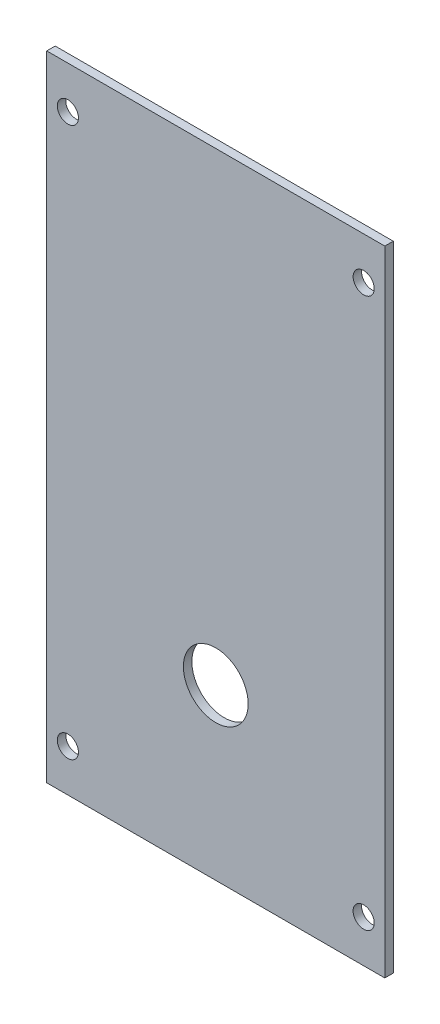
ISO-10303-21;
HEADER;
FILE_DESCRIPTION(('STEP AP214'),'2;1');
FILE_NAME('part.step','',(''),(''),'','','');
FILE_SCHEMA(('AUTOMOTIVE_DESIGN { 1 0 10303 214 1 1 1 1 }'));
ENDSEC;
DATA;
#1=APPLICATION_CONTEXT('core data for automotive mechanical design processes');
#2=APPLICATION_PROTOCOL_DEFINITION('international standard','automotive_design',2000,#1);
#3=PRODUCT_CONTEXT('',#1,'mechanical');
#4=PRODUCT('Part','Part','',(#3));
#5=PRODUCT_RELATED_PRODUCT_CATEGORY('part','',(#4));
#6=PRODUCT_DEFINITION_FORMATION('','',#4);
#7=PRODUCT_DEFINITION_CONTEXT('part definition',#1,'design');
#8=PRODUCT_DEFINITION('design','',#6,#7);
#9=PRODUCT_DEFINITION_SHAPE('','',#8);
#10=(LENGTH_UNIT() NAMED_UNIT(*) SI_UNIT(.MILLI.,.METRE.));
#11=(NAMED_UNIT(*) PLANE_ANGLE_UNIT() SI_UNIT($,.RADIAN.));
#12=(NAMED_UNIT(*) SI_UNIT($,.STERADIAN.) SOLID_ANGLE_UNIT());
#13=UNCERTAINTY_MEASURE_WITH_UNIT(LENGTH_MEASURE(1.E-05),#10,'distance_accuracy_value','');
#14=(GEOMETRIC_REPRESENTATION_CONTEXT(3) GLOBAL_UNCERTAINTY_ASSIGNED_CONTEXT((#13)) GLOBAL_UNIT_ASSIGNED_CONTEXT((#10,
#11,#12)) REPRESENTATION_CONTEXT('',''));
#15=CARTESIAN_POINT('',(0.,0.,0.));
#16=DIRECTION('',(0.,0.,1.));
#17=DIRECTION('',(1.,0.,0.));
#18=AXIS2_PLACEMENT_3D('',#15,#16,#17);
#19=CARTESIAN_POINT('',(0.,0.,1.));
#20=DIRECTION('',(0.,0.,1.));
#21=DIRECTION('',(1.,0.,0.));
#22=AXIS2_PLACEMENT_3D('',#19,#20,#21);
#23=PLANE('',#22);
#24=CARTESIAN_POINT('',(1.95121951219512,-5.56097560975612,1.));
#25=DIRECTION('',(0.,0.,1.));
#26=DIRECTION('',(1.,0.,0.));
#27=AXIS2_PLACEMENT_3D('',#24,#25,#26);
#28=CIRCLE('',#27,3.83203255109768);
#29=CARTESIAN_POINT('',(5.78325206329281,-5.56097560975612,1.));
#30=VERTEX_POINT('',#29);
#31=EDGE_CURVE('E169',#30,#30,#28,.T.);
#32=ORIENTED_EDGE('',*,*,#31,.F.);
#33=EDGE_LOOP('',(#32));
#34=FACE_BOUND('',#33,.T.);
#35=CARTESIAN_POINT('',(19.4512195121951,-20.5609756097561,1.));
#36=DIRECTION('',(0.,0.,1.));
#37=DIRECTION('',(1.,0.,0.));
#38=AXIS2_PLACEMENT_3D('',#35,#36,#37);
#39=CIRCLE('',#38,1.25);
#40=CARTESIAN_POINT('',(20.7012195121951,-20.5609756097561,1.));
#41=VERTEX_POINT('',#40);
#42=EDGE_CURVE('E150',#41,#41,#39,.T.);
#43=ORIENTED_EDGE('',*,*,#42,.F.);
#44=EDGE_LOOP('',(#43));
#45=FACE_BOUND('',#44,.T.);
#46=CARTESIAN_POINT('',(-15.5487804878049,44.4390243902439,1.));
#47=DIRECTION('',(0.,0.,1.));
#48=DIRECTION('',(1.,0.,0.));
#49=AXIS2_PLACEMENT_3D('',#46,#47,#48);
#50=CIRCLE('',#49,1.25);
#51=CARTESIAN_POINT('',(-14.2987804878049,44.4390243902439,1.));
#52=VERTEX_POINT('',#51);
#53=EDGE_CURVE('E120',#52,#52,#50,.T.);
#54=ORIENTED_EDGE('',*,*,#53,.F.);
#55=EDGE_LOOP('',(#54));
#56=FACE_BOUND('',#55,.T.);
#57=DIRECTION('',(0.,-1.,0.));
#58=VECTOR('',#57,1.);
#59=CARTESIAN_POINT('',(-18.0487804878049,49.4390243902439,1.));
#60=LINE('',#59,#58);
#61=CARTESIAN_POINT('',(-18.0487804878049,49.4390243902439,1.));
#62=VERTEX_POINT('',#61);
#63=CARTESIAN_POINT('',(-18.0487804878049,-25.5609756097561,1.));
#64=VERTEX_POINT('',#63);
#65=EDGE_CURVE('E99',#62,#64,#60,.T.);
#66=ORIENTED_EDGE('',*,*,#65,.T.);
#67=DIRECTION('',(1.,0.,0.));
#68=VECTOR('',#67,1.);
#69=CARTESIAN_POINT('',(-18.0487804878049,-25.5609756097561,1.));
#70=LINE('',#69,#68);
#71=CARTESIAN_POINT('',(21.9512195121951,-25.5609756097561,1.));
#72=VERTEX_POINT('',#71);
#73=EDGE_CURVE('E94',#64,#72,#70,.T.);
#74=ORIENTED_EDGE('',*,*,#73,.T.);
#75=DIRECTION('',(0.,1.,0.));
#76=VECTOR('',#75,1.);
#77=CARTESIAN_POINT('',(21.9512195121951,49.4390243902439,1.));
#78=LINE('',#77,#76);
#79=CARTESIAN_POINT('',(21.9512195121951,49.4390243902439,1.));
#80=VERTEX_POINT('',#79);
#81=EDGE_CURVE('E97',#72,#80,#78,.T.);
#82=ORIENTED_EDGE('',*,*,#81,.T.);
#83=DIRECTION('',(-1.,0.,0.));
#84=VECTOR('',#83,1.);
#85=CARTESIAN_POINT('',(-18.0487804878049,49.4390243902439,1.));
#86=LINE('',#85,#84);
#87=EDGE_CURVE('E64',#80,#62,#86,.T.);
#88=ORIENTED_EDGE('',*,*,#87,.T.);
#89=EDGE_LOOP('',(#66,#74,#82,#88));
#90=FACE_BOUND('',#89,.T.);
#91=CARTESIAN_POINT('',(19.4512195121951,44.4390243902439,1.));
#92=DIRECTION('',(0.,0.,1.));
#93=DIRECTION('',(1.,0.,0.));
#94=AXIS2_PLACEMENT_3D('',#91,#92,#93);
#95=CIRCLE('',#94,1.25);
#96=CARTESIAN_POINT('',(20.7012195121951,44.4390243902439,1.));
#97=VERTEX_POINT('',#96);
#98=EDGE_CURVE('E142',#97,#97,#95,.T.);
#99=ORIENTED_EDGE('',*,*,#98,.F.);
#100=EDGE_LOOP('',(#99));
#101=FACE_BOUND('',#100,.T.);
#102=CARTESIAN_POINT('',(-15.5487804878049,-20.5609756097561,1.));
#103=DIRECTION('',(0.,0.,1.));
#104=DIRECTION('',(1.,0.,0.));
#105=AXIS2_PLACEMENT_3D('',#102,#103,#104);
#106=CIRCLE('',#105,1.25);
#107=CARTESIAN_POINT('',(-14.2987804878049,-20.5609756097561,1.));
#108=VERTEX_POINT('',#107);
#109=EDGE_CURVE('E158',#108,#108,#106,.T.);
#110=ORIENTED_EDGE('',*,*,#109,.F.);
#111=EDGE_LOOP('',(#110));
#112=FACE_BOUND('',#111,.T.);
#113=ADVANCED_FACE('F45',(#34,#45,#56,#90,#101,#112),#23,.T.);
#114=CARTESIAN_POINT('',(0.,0.,0.));
#115=DIRECTION('',(0.,0.,1.));
#116=DIRECTION('',(1.,0.,0.));
#117=AXIS2_PLACEMENT_3D('',#114,#115,#116);
#118=PLANE('',#117);
#119=CARTESIAN_POINT('',(1.95121951219512,-5.56097560975612,0.));
#120=DIRECTION('',(0.,0.,1.));
#121=DIRECTION('',(1.,0.,0.));
#122=AXIS2_PLACEMENT_3D('',#119,#120,#121);
#123=CIRCLE('',#122,3.83203255109768);
#124=CARTESIAN_POINT('',(5.78325206329281,-5.56097560975612,0.));
#125=VERTEX_POINT('',#124);
#126=EDGE_CURVE('E49',#125,#125,#123,.T.);
#127=ORIENTED_EDGE('',*,*,#126,.T.);
#128=EDGE_LOOP('',(#127));
#129=FACE_BOUND('',#128,.T.);
#130=DIRECTION('',(0.,-1.,0.));
#131=VECTOR('',#130,1.);
#132=CARTESIAN_POINT('',(-18.0487804878049,49.4390243902439,0.));
#133=LINE('',#132,#131);
#134=CARTESIAN_POINT('',(-18.0487804878049,49.4390243902439,0.));
#135=VERTEX_POINT('',#134);
#136=CARTESIAN_POINT('',(-18.0487804878049,-25.5609756097561,0.));
#137=VERTEX_POINT('',#136);
#138=EDGE_CURVE('E116',#135,#137,#133,.T.);
#139=ORIENTED_EDGE('',*,*,#138,.F.);
#140=DIRECTION('',(-1.,0.,0.));
#141=VECTOR('',#140,1.);
#142=CARTESIAN_POINT('',(-18.0487804878049,49.4390243902439,0.));
#143=LINE('',#142,#141);
#144=CARTESIAN_POINT('',(21.9512195121951,49.4390243902439,0.));
#145=VERTEX_POINT('',#144);
#146=EDGE_CURVE('E87',#145,#135,#143,.T.);
#147=ORIENTED_EDGE('',*,*,#146,.F.);
#148=DIRECTION('',(0.,1.,0.));
#149=VECTOR('',#148,1.);
#150=CARTESIAN_POINT('',(21.9512195121951,49.4390243902439,0.));
#151=LINE('',#150,#149);
#152=CARTESIAN_POINT('',(21.9512195121951,-25.5609756097561,0.));
#153=VERTEX_POINT('',#152);
#154=EDGE_CURVE('E81',#153,#145,#151,.T.);
#155=ORIENTED_EDGE('',*,*,#154,.F.);
#156=DIRECTION('',(1.,0.,0.));
#157=VECTOR('',#156,1.);
#158=CARTESIAN_POINT('',(-18.0487804878049,-25.5609756097561,0.));
#159=LINE('',#158,#157);
#160=EDGE_CURVE('E104',#137,#153,#159,.T.);
#161=ORIENTED_EDGE('',*,*,#160,.F.);
#162=EDGE_LOOP('',(#139,#147,#155,#161));
#163=FACE_BOUND('',#162,.T.);
#164=CARTESIAN_POINT('',(-15.5487804878049,44.4390243902439,0.));
#165=DIRECTION('',(0.,0.,1.));
#166=DIRECTION('',(1.,0.,0.));
#167=AXIS2_PLACEMENT_3D('',#164,#165,#166);
#168=CIRCLE('',#167,1.25);
#169=CARTESIAN_POINT('',(-14.2987804878049,44.4390243902439,0.));
#170=VERTEX_POINT('',#169);
#171=EDGE_CURVE('E138',#170,#170,#168,.T.);
#172=ORIENTED_EDGE('',*,*,#171,.T.);
#173=EDGE_LOOP('',(#172));
#174=FACE_BOUND('',#173,.T.);
#175=CARTESIAN_POINT('',(19.4512195121951,44.4390243902439,0.));
#176=DIRECTION('',(0.,0.,1.));
#177=DIRECTION('',(1.,0.,0.));
#178=AXIS2_PLACEMENT_3D('',#175,#176,#177);
#179=CIRCLE('',#178,1.25);
#180=CARTESIAN_POINT('',(20.7012195121951,44.4390243902439,0.));
#181=VERTEX_POINT('',#180);
#182=EDGE_CURVE('E146',#181,#181,#179,.T.);
#183=ORIENTED_EDGE('',*,*,#182,.T.);
#184=EDGE_LOOP('',(#183));
#185=FACE_BOUND('',#184,.T.);
#186=CARTESIAN_POINT('',(19.4512195121951,-20.5609756097561,0.));
#187=DIRECTION('',(0.,0.,1.));
#188=DIRECTION('',(1.,0.,0.));
#189=AXIS2_PLACEMENT_3D('',#186,#187,#188);
#190=CIRCLE('',#189,1.25);
#191=CARTESIAN_POINT('',(20.7012195121951,-20.5609756097561,0.));
#192=VERTEX_POINT('',#191);
#193=EDGE_CURVE('E154',#192,#192,#190,.T.);
#194=ORIENTED_EDGE('',*,*,#193,.T.);
#195=EDGE_LOOP('',(#194));
#196=FACE_BOUND('',#195,.T.);
#197=CARTESIAN_POINT('',(-15.5487804878049,-20.5609756097561,0.));
#198=DIRECTION('',(0.,0.,1.));
#199=DIRECTION('',(1.,0.,0.));
#200=AXIS2_PLACEMENT_3D('',#197,#198,#199);
#201=CIRCLE('',#200,1.25);
#202=CARTESIAN_POINT('',(-14.2987804878049,-20.5609756097561,0.));
#203=VERTEX_POINT('',#202);
#204=EDGE_CURVE('E162',#203,#203,#201,.T.);
#205=ORIENTED_EDGE('',*,*,#204,.T.);
#206=EDGE_LOOP('',(#205));
#207=FACE_BOUND('',#206,.T.);
#208=ADVANCED_FACE('F133',(#129,#163,#174,#185,#196,#207),#118,.F.);
#209=CARTESIAN_POINT('',(-18.0487804878049,49.4390243902439,1.));
#210=DIRECTION('',(1.,0.,0.));
#211=DIRECTION('',(0.,1.,0.));
#212=AXIS2_PLACEMENT_3D('',#209,#210,#211);
#213=PLANE('',#212);
#214=ORIENTED_EDGE('',*,*,#138,.T.);
#215=DIRECTION('',(0.,0.,-1.));
#216=VECTOR('',#215,1.);
#217=CARTESIAN_POINT('',(-18.0487804878049,-25.5609756097561,1.));
#218=LINE('',#217,#216);
#219=EDGE_CURVE('E11',#64,#137,#218,.T.);
#220=ORIENTED_EDGE('',*,*,#219,.F.);
#221=ORIENTED_EDGE('',*,*,#65,.F.);
#222=DIRECTION('',(0.,0.,-1.));
#223=VECTOR('',#222,1.);
#224=CARTESIAN_POINT('',(-18.0487804878049,49.4390243902439,1.));
#225=LINE('',#224,#223);
#226=EDGE_CURVE('E112',#62,#135,#225,.T.);
#227=ORIENTED_EDGE('',*,*,#226,.T.);
#228=EDGE_LOOP('',(#214,#220,#221,#227));
#229=FACE_BOUND('',#228,.T.);
#230=ADVANCED_FACE('F47',(#229),#213,.F.);
#231=CARTESIAN_POINT('',(-18.0487804878049,-25.5609756097561,1.));
#232=DIRECTION('',(0.,1.,0.));
#233=DIRECTION('',(0.,0.,1.));
#234=AXIS2_PLACEMENT_3D('',#231,#232,#233);
#235=PLANE('',#234);
#236=ORIENTED_EDGE('',*,*,#160,.T.);
#237=DIRECTION('',(0.,0.,-1.));
#238=VECTOR('',#237,1.);
#239=CARTESIAN_POINT('',(21.9512195121951,-25.5609756097561,1.));
#240=LINE('',#239,#238);
#241=EDGE_CURVE('E56',#72,#153,#240,.T.);
#242=ORIENTED_EDGE('',*,*,#241,.F.);
#243=ORIENTED_EDGE('',*,*,#73,.F.);
#244=ORIENTED_EDGE('',*,*,#219,.T.);
#245=EDGE_LOOP('',(#236,#242,#243,#244));
#246=FACE_BOUND('',#245,.T.);
#247=ADVANCED_FACE('F103',(#246),#235,.F.);
#248=CARTESIAN_POINT('',(21.9512195121951,49.4390243902439,1.));
#249=DIRECTION('',(-1.,0.,0.));
#250=DIRECTION('',(0.,-1.,0.));
#251=AXIS2_PLACEMENT_3D('',#248,#249,#250);
#252=PLANE('',#251);
#253=ORIENTED_EDGE('',*,*,#154,.T.);
#254=DIRECTION('',(0.,0.,-1.));
#255=VECTOR('',#254,1.);
#256=CARTESIAN_POINT('',(21.9512195121951,49.4390243902439,1.));
#257=LINE('',#256,#255);
#258=EDGE_CURVE('E106',#80,#145,#257,.T.);
#259=ORIENTED_EDGE('',*,*,#258,.F.);
#260=ORIENTED_EDGE('',*,*,#81,.F.);
#261=ORIENTED_EDGE('',*,*,#241,.T.);
#262=EDGE_LOOP('',(#253,#259,#260,#261));
#263=FACE_BOUND('',#262,.T.);
#264=ADVANCED_FACE('F108',(#263),#252,.F.);
#265=CARTESIAN_POINT('',(-18.0487804878049,49.4390243902439,1.));
#266=DIRECTION('',(0.,-1.,0.));
#267=DIRECTION('',(0.,0.,-1.));
#268=AXIS2_PLACEMENT_3D('',#265,#266,#267);
#269=PLANE('',#268);
#270=ORIENTED_EDGE('',*,*,#146,.T.);
#271=ORIENTED_EDGE('',*,*,#226,.F.);
#272=ORIENTED_EDGE('',*,*,#87,.F.);
#273=ORIENTED_EDGE('',*,*,#258,.T.);
#274=EDGE_LOOP('',(#270,#271,#272,#273));
#275=FACE_BOUND('',#274,.T.);
#276=ADVANCED_FACE('F130',(#275),#269,.F.);
#277=CARTESIAN_POINT('',(-15.5487804878049,44.4390243902439,1.));
#278=DIRECTION('',(0.,0.,-1.));
#279=DIRECTION('',(-1.,0.,0.));
#280=AXIS2_PLACEMENT_3D('',#277,#278,#279);
#281=CYLINDRICAL_SURFACE('',#280,1.25);
#282=ORIENTED_EDGE('',*,*,#53,.T.);
#283=EDGE_LOOP('',(#282));
#284=FACE_BOUND('',#283,.T.);
#285=ORIENTED_EDGE('',*,*,#171,.F.);
#286=EDGE_LOOP('',(#285));
#287=FACE_BOUND('',#286,.T.);
#288=ADVANCED_FACE('F198',(#284,#287),#281,.F.);
#289=CARTESIAN_POINT('',(19.4512195121951,44.4390243902439,1.));
#290=DIRECTION('',(0.,0.,-1.));
#291=DIRECTION('',(-1.,0.,0.));
#292=AXIS2_PLACEMENT_3D('',#289,#290,#291);
#293=CYLINDRICAL_SURFACE('',#292,1.25);
#294=ORIENTED_EDGE('',*,*,#98,.T.);
#295=EDGE_LOOP('',(#294));
#296=FACE_BOUND('',#295,.T.);
#297=ORIENTED_EDGE('',*,*,#182,.F.);
#298=EDGE_LOOP('',(#297));
#299=FACE_BOUND('',#298,.T.);
#300=ADVANCED_FACE('F240',(#296,#299),#293,.F.);
#301=CARTESIAN_POINT('',(19.4512195121951,-20.5609756097561,1.));
#302=DIRECTION('',(0.,0.,-1.));
#303=DIRECTION('',(-1.,0.,0.));
#304=AXIS2_PLACEMENT_3D('',#301,#302,#303);
#305=CYLINDRICAL_SURFACE('',#304,1.25);
#306=ORIENTED_EDGE('',*,*,#42,.T.);
#307=EDGE_LOOP('',(#306));
#308=FACE_BOUND('',#307,.T.);
#309=ORIENTED_EDGE('',*,*,#193,.F.);
#310=EDGE_LOOP('',(#309));
#311=FACE_BOUND('',#310,.T.);
#312=ADVANCED_FACE('F187',(#308,#311),#305,.F.);
#313=CARTESIAN_POINT('',(-15.5487804878049,-20.5609756097561,1.));
#314=DIRECTION('',(0.,0.,-1.));
#315=DIRECTION('',(-1.,0.,0.));
#316=AXIS2_PLACEMENT_3D('',#313,#314,#315);
#317=CYLINDRICAL_SURFACE('',#316,1.25);
#318=ORIENTED_EDGE('',*,*,#109,.T.);
#319=EDGE_LOOP('',(#318));
#320=FACE_BOUND('',#319,.T.);
#321=ORIENTED_EDGE('',*,*,#204,.F.);
#322=EDGE_LOOP('',(#321));
#323=FACE_BOUND('',#322,.T.);
#324=ADVANCED_FACE('F181',(#320,#323),#317,.F.);
#325=CARTESIAN_POINT('',(1.95121951219512,-5.56097560975612,-9.));
#326=DIRECTION('',(0.,0.,1.));
#327=DIRECTION('',(1.,0.,0.));
#328=AXIS2_PLACEMENT_3D('',#325,#326,#327);
#329=CYLINDRICAL_SURFACE('',#328,3.83203255109768);
#330=ORIENTED_EDGE('',*,*,#31,.T.);
#331=EDGE_LOOP('',(#330));
#332=FACE_BOUND('',#331,.T.);
#333=ORIENTED_EDGE('',*,*,#126,.F.);
#334=EDGE_LOOP('',(#333));
#335=FACE_BOUND('',#334,.T.);
#336=ADVANCED_FACE('F179',(#332,#335),#329,.F.);
#337=CLOSED_SHELL('',(#113,#208,#230,#247,#264,#276,#288,#300,#312,#324,#336));
#338=MANIFOLD_SOLID_BREP('B2',#337);
#339=ADVANCED_BREP_SHAPE_REPRESENTATION('',(#18,#338),#14);
#340=SHAPE_DEFINITION_REPRESENTATION(#9,#339);
ENDSEC;
END-ISO-10303-21;
